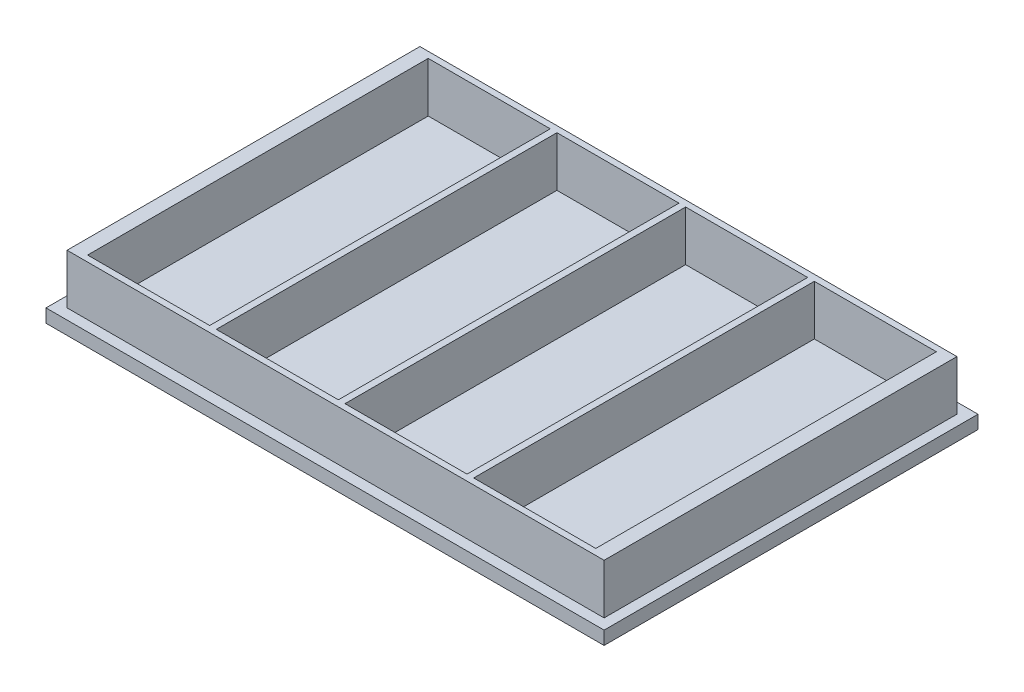
ISO-10303-21;
HEADER;
FILE_DESCRIPTION(('STEP AP214'),'2;1');
FILE_NAME('part.step','',(''),(''),'','','');
FILE_SCHEMA(('AUTOMOTIVE_DESIGN { 1 0 10303 214 1 1 1 1 }'));
ENDSEC;
DATA;
#1=APPLICATION_CONTEXT('core data for automotive mechanical design processes');
#2=APPLICATION_PROTOCOL_DEFINITION('international standard','automotive_design',2000,#1);
#3=PRODUCT_CONTEXT('',#1,'mechanical');
#4=PRODUCT('Part','Part','',(#3));
#5=PRODUCT_RELATED_PRODUCT_CATEGORY('part','',(#4));
#6=PRODUCT_DEFINITION_FORMATION('','',#4);
#7=PRODUCT_DEFINITION_CONTEXT('part definition',#1,'design');
#8=PRODUCT_DEFINITION('design','',#6,#7);
#9=PRODUCT_DEFINITION_SHAPE('','',#8);
#10=(LENGTH_UNIT() NAMED_UNIT(*) SI_UNIT(.MILLI.,.METRE.));
#11=(NAMED_UNIT(*) PLANE_ANGLE_UNIT() SI_UNIT($,.RADIAN.));
#12=(NAMED_UNIT(*) SI_UNIT($,.STERADIAN.) SOLID_ANGLE_UNIT());
#13=UNCERTAINTY_MEASURE_WITH_UNIT(LENGTH_MEASURE(1.E-05),#10,'distance_accuracy_value','');
#14=(GEOMETRIC_REPRESENTATION_CONTEXT(3) GLOBAL_UNCERTAINTY_ASSIGNED_CONTEXT((#13)) GLOBAL_UNIT_ASSIGNED_CONTEXT((#10,
#11,#12)) REPRESENTATION_CONTEXT('',''));
#15=CARTESIAN_POINT('',(0.,0.,0.));
#16=DIRECTION('',(0.,0.,1.));
#17=DIRECTION('',(1.,0.,0.));
#18=AXIS2_PLACEMENT_3D('',#15,#16,#17);
#19=CARTESIAN_POINT('',(0.,3.048,0.));
#20=DIRECTION('',(0.,1.,0.));
#21=DIRECTION('',(0.,0.,1.));
#22=AXIS2_PLACEMENT_3D('',#19,#20,#21);
#23=PLANE('',#22);
#24=DIRECTION('',(1.,0.,0.));
#25=VECTOR('',#24,1.);
#26=CARTESIAN_POINT('',(0.,3.048,2.413));
#27=LINE('',#26,#25);
#28=CARTESIAN_POINT('',(2.413,3.048,2.413));
#29=VERTEX_POINT('',#28);
#30=CARTESIAN_POINT('',(125.349,3.048,2.413));
#31=VERTEX_POINT('',#30);
#32=EDGE_CURVE('E337',#29,#31,#27,.T.);
#33=ORIENTED_EDGE('',*,*,#32,.T.);
#34=DIRECTION('',(0.,0.,1.));
#35=VECTOR('',#34,1.);
#36=CARTESIAN_POINT('',(125.349,3.048,0.));
#37=LINE('',#36,#35);
#38=CARTESIAN_POINT('',(125.349,3.048,83.185));
#39=VERTEX_POINT('',#38);
#40=EDGE_CURVE('E295',#31,#39,#37,.T.);
#41=ORIENTED_EDGE('',*,*,#40,.T.);
#42=DIRECTION('',(1.,0.,0.));
#43=VECTOR('',#42,1.);
#44=CARTESIAN_POINT('',(0.,3.048,83.185));
#45=LINE('',#44,#43);
#46=CARTESIAN_POINT('',(2.413,3.048,83.185));
#47=VERTEX_POINT('',#46);
#48=EDGE_CURVE('E126',#47,#39,#45,.T.);
#49=ORIENTED_EDGE('',*,*,#48,.F.);
#50=DIRECTION('',(0.,0.,1.));
#51=VECTOR('',#50,1.);
#52=CARTESIAN_POINT('',(2.413,3.048,0.));
#53=LINE('',#52,#51);
#54=EDGE_CURVE('E121',#29,#47,#53,.T.);
#55=ORIENTED_EDGE('',*,*,#54,.F.);
#56=EDGE_LOOP('',(#33,#41,#49,#55));
#57=FACE_BOUND('',#56,.T.);
#58=DIRECTION('',(0.,0.,1.));
#59=VECTOR('',#58,1.);
#60=CARTESIAN_POINT('',(0.,3.048,0.));
#61=LINE('',#60,#59);
#62=CARTESIAN_POINT('',(0.,3.048,0.));
#63=VERTEX_POINT('',#62);
#64=CARTESIAN_POINT('',(0.,3.048,85.598));
#65=VERTEX_POINT('',#64);
#66=EDGE_CURVE('E462',#63,#65,#61,.T.);
#67=ORIENTED_EDGE('',*,*,#66,.T.);
#68=DIRECTION('',(1.,0.,0.));
#69=VECTOR('',#68,1.);
#70=CARTESIAN_POINT('',(0.,3.048,85.598));
#71=LINE('',#70,#69);
#72=CARTESIAN_POINT('',(127.762,3.048,85.598));
#73=VERTEX_POINT('',#72);
#74=EDGE_CURVE('E465',#65,#73,#71,.T.);
#75=ORIENTED_EDGE('',*,*,#74,.T.);
#76=DIRECTION('',(0.,0.,-1.));
#77=VECTOR('',#76,1.);
#78=CARTESIAN_POINT('',(127.762,3.048,0.));
#79=LINE('',#78,#77);
#80=CARTESIAN_POINT('',(127.762,3.048,0.));
#81=VERTEX_POINT('',#80);
#82=EDGE_CURVE('E468',#73,#81,#79,.T.);
#83=ORIENTED_EDGE('',*,*,#82,.T.);
#84=DIRECTION('',(-1.,0.,0.));
#85=VECTOR('',#84,1.);
#86=CARTESIAN_POINT('',(0.,3.048,0.));
#87=LINE('',#86,#85);
#88=EDGE_CURVE('E470',#81,#63,#87,.T.);
#89=ORIENTED_EDGE('',*,*,#88,.T.);
#90=EDGE_LOOP('',(#67,#75,#83,#89));
#91=FACE_BOUND('',#90,.T.);
#92=ADVANCED_FACE('F106',(#57,#91),#23,.T.);
#93=CARTESIAN_POINT('',(2.413,3.048,2.413));
#94=DIRECTION('',(1.,0.,0.));
#95=DIRECTION('',(0.,0.,-1.));
#96=AXIS2_PLACEMENT_3D('',#93,#94,#95);
#97=PLANE('',#96);
#98=DIRECTION('',(0.,-1.,0.));
#99=VECTOR('',#98,1.);
#100=CARTESIAN_POINT('',(2.413,3.048,2.413));
#101=LINE('',#100,#99);
#102=CARTESIAN_POINT('',(2.413,0.635000000000001,2.413));
#103=VERTEX_POINT('',#102);
#104=CARTESIAN_POINT('',(2.413,0.,2.413));
#105=VERTEX_POINT('',#104);
#106=EDGE_CURVE('E453',#103,#105,#101,.T.);
#107=ORIENTED_EDGE('',*,*,#106,.F.);
#108=DIRECTION('',(0.,0.,1.));
#109=VECTOR('',#108,1.);
#110=CARTESIAN_POINT('',(2.413,0.635,2.413));
#111=LINE('',#110,#109);
#112=CARTESIAN_POINT('',(2.413,0.635,83.185));
#113=VERTEX_POINT('',#112);
#114=EDGE_CURVE('E393',#103,#113,#111,.T.);
#115=ORIENTED_EDGE('',*,*,#114,.T.);
#116=DIRECTION('',(0.,-1.,0.));
#117=VECTOR('',#116,1.);
#118=CARTESIAN_POINT('',(2.41300000000001,3.048,83.185));
#119=LINE('',#118,#117);
#120=CARTESIAN_POINT('',(2.41300000000001,0.,83.185));
#121=VERTEX_POINT('',#120);
#122=EDGE_CURVE('E459',#113,#121,#119,.T.);
#123=ORIENTED_EDGE('',*,*,#122,.T.);
#124=DIRECTION('',(0.,0.,1.));
#125=VECTOR('',#124,1.);
#126=CARTESIAN_POINT('',(2.413,0.,2.413));
#127=LINE('',#126,#125);
#128=EDGE_CURVE('E441',#105,#121,#127,.T.);
#129=ORIENTED_EDGE('',*,*,#128,.F.);
#130=EDGE_LOOP('',(#107,#115,#123,#129));
#131=FACE_BOUND('',#130,.T.);
#132=ADVANCED_FACE('F513',(#131),#97,.T.);
#133=CARTESIAN_POINT('',(2.41300000000001,3.048,83.185));
#134=DIRECTION('',(0.,0.,-1.));
#135=DIRECTION('',(-1.,0.,0.));
#136=AXIS2_PLACEMENT_3D('',#133,#134,#135);
#137=PLANE('',#136);
#138=ORIENTED_EDGE('',*,*,#122,.F.);
#139=DIRECTION('',(1.,0.,0.));
#140=VECTOR('',#139,1.);
#141=CARTESIAN_POINT('',(2.413,0.635,83.185));
#142=LINE('',#141,#140);
#143=CARTESIAN_POINT('',(125.349,0.635,83.185));
#144=VERTEX_POINT('',#143);
#145=EDGE_CURVE('E432',#113,#144,#142,.T.);
#146=ORIENTED_EDGE('',*,*,#145,.T.);
#147=DIRECTION('',(0.,-1.,0.));
#148=VECTOR('',#147,1.);
#149=CARTESIAN_POINT('',(125.349,3.048,83.185));
#150=LINE('',#149,#148);
#151=CARTESIAN_POINT('',(125.349,0.,83.185));
#152=VERTEX_POINT('',#151);
#153=EDGE_CURVE('E457',#144,#152,#150,.T.);
#154=ORIENTED_EDGE('',*,*,#153,.T.);
#155=DIRECTION('',(1.,0.,0.));
#156=VECTOR('',#155,1.);
#157=CARTESIAN_POINT('',(2.41300000000001,0.,83.185));
#158=LINE('',#157,#156);
#159=EDGE_CURVE('E444',#121,#152,#158,.T.);
#160=ORIENTED_EDGE('',*,*,#159,.F.);
#161=EDGE_LOOP('',(#138,#146,#154,#160));
#162=FACE_BOUND('',#161,.T.);
#163=ADVANCED_FACE('F520',(#162),#137,.T.);
#164=CARTESIAN_POINT('',(125.349,3.048,2.413));
#165=DIRECTION('',(-1.,0.,0.));
#166=DIRECTION('',(0.,0.,1.));
#167=AXIS2_PLACEMENT_3D('',#164,#165,#166);
#168=PLANE('',#167);
#169=ORIENTED_EDGE('',*,*,#153,.F.);
#170=DIRECTION('',(0.,0.,-1.));
#171=VECTOR('',#170,1.);
#172=CARTESIAN_POINT('',(125.349,0.635,2.413));
#173=LINE('',#172,#171);
#174=CARTESIAN_POINT('',(125.349,0.635,2.413));
#175=VERTEX_POINT('',#174);
#176=EDGE_CURVE('E435',#144,#175,#173,.T.);
#177=ORIENTED_EDGE('',*,*,#176,.T.);
#178=DIRECTION('',(0.,-1.,0.));
#179=VECTOR('',#178,1.);
#180=CARTESIAN_POINT('',(125.349,3.048,2.413));
#181=LINE('',#180,#179);
#182=CARTESIAN_POINT('',(125.349,0.,2.413));
#183=VERTEX_POINT('',#182);
#184=EDGE_CURVE('E455',#175,#183,#181,.T.);
#185=ORIENTED_EDGE('',*,*,#184,.T.);
#186=DIRECTION('',(0.,0.,-1.));
#187=VECTOR('',#186,1.);
#188=CARTESIAN_POINT('',(125.349,0.,2.413));
#189=LINE('',#188,#187);
#190=EDGE_CURVE('E447',#152,#183,#189,.T.);
#191=ORIENTED_EDGE('',*,*,#190,.F.);
#192=EDGE_LOOP('',(#169,#177,#185,#191));
#193=FACE_BOUND('',#192,.T.);
#194=ADVANCED_FACE('F659',(#193),#168,.T.);
#195=CARTESIAN_POINT('',(2.413,3.048,2.413));
#196=DIRECTION('',(0.,0.,1.));
#197=DIRECTION('',(1.,0.,0.));
#198=AXIS2_PLACEMENT_3D('',#195,#196,#197);
#199=PLANE('',#198);
#200=ORIENTED_EDGE('',*,*,#184,.F.);
#201=DIRECTION('',(-1.,0.,0.));
#202=VECTOR('',#201,1.);
#203=CARTESIAN_POINT('',(2.413,0.635,2.413));
#204=LINE('',#203,#202);
#205=EDGE_CURVE('E438',#175,#103,#204,.T.);
#206=ORIENTED_EDGE('',*,*,#205,.T.);
#207=ORIENTED_EDGE('',*,*,#106,.T.);
#208=DIRECTION('',(-1.,0.,0.));
#209=VECTOR('',#208,1.);
#210=CARTESIAN_POINT('',(2.413,0.,2.413));
#211=LINE('',#210,#209);
#212=EDGE_CURVE('E450',#183,#105,#211,.T.);
#213=ORIENTED_EDGE('',*,*,#212,.F.);
#214=EDGE_LOOP('',(#200,#206,#207,#213));
#215=FACE_BOUND('',#214,.T.);
#216=ADVANCED_FACE('F656',(#215),#199,.T.);
#217=CARTESIAN_POINT('',(0.,0.,0.));
#218=DIRECTION('',(0.,1.,0.));
#219=DIRECTION('',(0.,0.,1.));
#220=AXIS2_PLACEMENT_3D('',#217,#218,#219);
#221=PLANE('',#220);
#222=DIRECTION('',(0.,0.,1.));
#223=VECTOR('',#222,1.);
#224=CARTESIAN_POINT('',(0.,0.,0.));
#225=LINE('',#224,#223);
#226=CARTESIAN_POINT('',(0.,0.,0.));
#227=VERTEX_POINT('',#226);
#228=CARTESIAN_POINT('',(0.,0.,85.598));
#229=VERTEX_POINT('',#228);
#230=EDGE_CURVE('E461',#227,#229,#225,.T.);
#231=ORIENTED_EDGE('',*,*,#230,.F.);
#232=DIRECTION('',(-1.,0.,0.));
#233=VECTOR('',#232,1.);
#234=CARTESIAN_POINT('',(0.,0.,0.));
#235=LINE('',#234,#233);
#236=CARTESIAN_POINT('',(127.762,0.,0.));
#237=VERTEX_POINT('',#236);
#238=EDGE_CURVE('E466',#237,#227,#235,.T.);
#239=ORIENTED_EDGE('',*,*,#238,.F.);
#240=DIRECTION('',(0.,0.,-1.));
#241=VECTOR('',#240,1.);
#242=CARTESIAN_POINT('',(127.762,0.,0.));
#243=LINE('',#242,#241);
#244=CARTESIAN_POINT('',(127.762,0.,85.598));
#245=VERTEX_POINT('',#244);
#246=EDGE_CURVE('E477',#245,#237,#243,.T.);
#247=ORIENTED_EDGE('',*,*,#246,.F.);
#248=DIRECTION('',(1.,0.,0.));
#249=VECTOR('',#248,1.);
#250=CARTESIAN_POINT('',(0.,0.,85.598));
#251=LINE('',#250,#249);
#252=EDGE_CURVE('E475',#229,#245,#251,.T.);
#253=ORIENTED_EDGE('',*,*,#252,.F.);
#254=EDGE_LOOP('',(#231,#239,#247,#253));
#255=FACE_BOUND('',#254,.T.);
#256=ORIENTED_EDGE('',*,*,#128,.T.);
#257=ORIENTED_EDGE('',*,*,#159,.T.);
#258=ORIENTED_EDGE('',*,*,#190,.T.);
#259=ORIENTED_EDGE('',*,*,#212,.T.);
#260=EDGE_LOOP('',(#256,#257,#258,#259));
#261=FACE_BOUND('',#260,.T.);
#262=ADVANCED_FACE('F495',(#255,#261),#221,.F.);
#263=CARTESIAN_POINT('',(0.,3.048,0.));
#264=DIRECTION('',(1.,0.,0.));
#265=DIRECTION('',(0.,0.,-1.));
#266=AXIS2_PLACEMENT_3D('',#263,#264,#265);
#267=PLANE('',#266);
#268=ORIENTED_EDGE('',*,*,#230,.T.);
#269=DIRECTION('',(0.,-1.,0.));
#270=VECTOR('',#269,1.);
#271=CARTESIAN_POINT('',(0.,3.048,85.598));
#272=LINE('',#271,#270);
#273=EDGE_CURVE('E12',#65,#229,#272,.T.);
#274=ORIENTED_EDGE('',*,*,#273,.F.);
#275=ORIENTED_EDGE('',*,*,#66,.F.);
#276=DIRECTION('',(0.,-1.,0.));
#277=VECTOR('',#276,1.);
#278=CARTESIAN_POINT('',(0.,3.048,0.));
#279=LINE('',#278,#277);
#280=EDGE_CURVE('E472',#63,#227,#279,.T.);
#281=ORIENTED_EDGE('',*,*,#280,.T.);
#282=EDGE_LOOP('',(#268,#274,#275,#281));
#283=FACE_BOUND('',#282,.T.);
#284=ADVANCED_FACE('F108',(#283),#267,.F.);
#285=CARTESIAN_POINT('',(0.,3.048,85.598));
#286=DIRECTION('',(0.,0.,-1.));
#287=DIRECTION('',(-1.,0.,0.));
#288=AXIS2_PLACEMENT_3D('',#285,#286,#287);
#289=PLANE('',#288);
#290=ORIENTED_EDGE('',*,*,#252,.T.);
#291=DIRECTION('',(0.,-1.,0.));
#292=VECTOR('',#291,1.);
#293=CARTESIAN_POINT('',(127.762,3.048,85.598));
#294=LINE('',#293,#292);
#295=EDGE_CURVE('E114',#73,#245,#294,.T.);
#296=ORIENTED_EDGE('',*,*,#295,.F.);
#297=ORIENTED_EDGE('',*,*,#74,.F.);
#298=ORIENTED_EDGE('',*,*,#273,.T.);
#299=EDGE_LOOP('',(#290,#296,#297,#298));
#300=FACE_BOUND('',#299,.T.);
#301=ADVANCED_FACE('F505',(#300),#289,.F.);
#302=CARTESIAN_POINT('',(127.762,3.048,0.));
#303=DIRECTION('',(-1.,0.,0.));
#304=DIRECTION('',(0.,0.,1.));
#305=AXIS2_PLACEMENT_3D('',#302,#303,#304);
#306=PLANE('',#305);
#307=ORIENTED_EDGE('',*,*,#246,.T.);
#308=DIRECTION('',(0.,-1.,0.));
#309=VECTOR('',#308,1.);
#310=CARTESIAN_POINT('',(127.762,3.048,0.));
#311=LINE('',#310,#309);
#312=EDGE_CURVE('E482',#81,#237,#311,.T.);
#313=ORIENTED_EDGE('',*,*,#312,.F.);
#314=ORIENTED_EDGE('',*,*,#82,.F.);
#315=ORIENTED_EDGE('',*,*,#295,.T.);
#316=EDGE_LOOP('',(#307,#313,#314,#315));
#317=FACE_BOUND('',#316,.T.);
#318=ADVANCED_FACE('F489',(#317),#306,.F.);
#319=CARTESIAN_POINT('',(0.,3.048,0.));
#320=DIRECTION('',(0.,0.,1.));
#321=DIRECTION('',(1.,0.,0.));
#322=AXIS2_PLACEMENT_3D('',#319,#320,#321);
#323=PLANE('',#322);
#324=ORIENTED_EDGE('',*,*,#238,.T.);
#325=ORIENTED_EDGE('',*,*,#280,.F.);
#326=ORIENTED_EDGE('',*,*,#88,.F.);
#327=ORIENTED_EDGE('',*,*,#312,.T.);
#328=EDGE_LOOP('',(#324,#325,#326,#327));
#329=FACE_BOUND('',#328,.T.);
#330=ADVANCED_FACE('F499',(#329),#323,.F.);
#331=CARTESIAN_POINT('',(0.,0.635,0.));
#332=DIRECTION('',(0.,1.,0.));
#333=DIRECTION('',(0.,0.,1.));
#334=AXIS2_PLACEMENT_3D('',#331,#332,#333);
#335=PLANE('',#334);
#336=ORIENTED_EDGE('',*,*,#114,.F.);
#337=ORIENTED_EDGE('',*,*,#205,.F.);
#338=ORIENTED_EDGE('',*,*,#176,.F.);
#339=ORIENTED_EDGE('',*,*,#145,.F.);
#340=EDGE_LOOP('',(#336,#337,#338,#339));
#341=FACE_BOUND('',#340,.T.);
#342=ADVANCED_FACE('F624',(#341),#335,.F.);
#343=CARTESIAN_POINT('',(0.,14.478,3.81));
#344=DIRECTION('',(0.,0.,-1.));
#345=DIRECTION('',(-1.,0.,0.));
#346=AXIS2_PLACEMENT_3D('',#343,#344,#345);
#347=PLANE('',#346);
#348=DIRECTION('',(1.,0.,0.));
#349=VECTOR('',#348,1.);
#350=CARTESIAN_POINT('',(0.,14.478,3.81));
#351=LINE('',#350,#349);
#352=CARTESIAN_POINT('',(35.179,14.478,3.81));
#353=VERTEX_POINT('',#352);
#354=CARTESIAN_POINT('',(63.119,14.478,3.81));
#355=VERTEX_POINT('',#354);
#356=EDGE_CURVE('E324',#353,#355,#351,.T.);
#357=ORIENTED_EDGE('',*,*,#356,.F.);
#358=DIRECTION('',(0.,-1.,0.));
#359=VECTOR('',#358,1.);
#360=CARTESIAN_POINT('',(35.179,14.478,3.81));
#361=LINE('',#360,#359);
#362=CARTESIAN_POINT('',(35.179,3.048,3.81));
#363=VERTEX_POINT('',#362);
#364=EDGE_CURVE('E387',#353,#363,#361,.T.);
#365=ORIENTED_EDGE('',*,*,#364,.T.);
#366=DIRECTION('',(1.,0.,0.));
#367=VECTOR('',#366,1.);
#368=CARTESIAN_POINT('',(0.,3.048,3.81));
#369=LINE('',#368,#367);
#370=CARTESIAN_POINT('',(63.119,3.048,3.81));
#371=VERTEX_POINT('',#370);
#372=EDGE_CURVE('E346',#363,#371,#369,.T.);
#373=ORIENTED_EDGE('',*,*,#372,.T.);
#374=DIRECTION('',(0.,1.,0.));
#375=VECTOR('',#374,1.);
#376=CARTESIAN_POINT('',(63.119,14.478,3.81));
#377=LINE('',#376,#375);
#378=EDGE_CURVE('E384',#371,#355,#377,.T.);
#379=ORIENTED_EDGE('',*,*,#378,.T.);
#380=EDGE_LOOP('',(#357,#365,#373,#379));
#381=FACE_BOUND('',#380,.T.);
#382=ADVANCED_FACE('F555',(#381),#347,.F.);
#383=CARTESIAN_POINT('',(64.643,14.478,3.81));
#384=VERTEX_POINT('',#383);
#385=CARTESIAN_POINT('',(92.583,14.478,3.81));
#386=VERTEX_POINT('',#385);
#387=EDGE_CURVE('E597',#384,#386,#351,.T.);
#388=ORIENTED_EDGE('',*,*,#387,.F.);
#389=DIRECTION('',(0.,-1.,0.));
#390=VECTOR('',#389,1.);
#391=CARTESIAN_POINT('',(64.643,14.478,3.81));
#392=LINE('',#391,#390);
#393=CARTESIAN_POINT('',(64.643,3.048,3.81));
#394=VERTEX_POINT('',#393);
#395=EDGE_CURVE('E386',#384,#394,#392,.T.);
#396=ORIENTED_EDGE('',*,*,#395,.T.);
#397=CARTESIAN_POINT('',(92.583,3.048,3.81));
#398=VERTEX_POINT('',#397);
#399=EDGE_CURVE('E557',#394,#398,#369,.T.);
#400=ORIENTED_EDGE('',*,*,#399,.T.);
#401=DIRECTION('',(0.,1.,0.));
#402=VECTOR('',#401,1.);
#403=CARTESIAN_POINT('',(92.583,14.478,3.81));
#404=LINE('',#403,#402);
#405=EDGE_CURVE('E381',#398,#386,#404,.T.);
#406=ORIENTED_EDGE('',*,*,#405,.T.);
#407=EDGE_LOOP('',(#388,#396,#400,#406));
#408=FACE_BOUND('',#407,.T.);
#409=ADVANCED_FACE('F620',(#408),#347,.F.);
#410=CARTESIAN_POINT('',(94.107,14.478,3.81));
#411=VERTEX_POINT('',#410);
#412=CARTESIAN_POINT('',(122.047,14.478,3.81));
#413=VERTEX_POINT('',#412);
#414=EDGE_CURVE('E319',#411,#413,#351,.T.);
#415=ORIENTED_EDGE('',*,*,#414,.F.);
#416=DIRECTION('',(0.,-1.,0.));
#417=VECTOR('',#416,1.);
#418=CARTESIAN_POINT('',(94.107,14.478,3.81));
#419=LINE('',#418,#417);
#420=CARTESIAN_POINT('',(94.107,3.048,3.81));
#421=VERTEX_POINT('',#420);
#422=EDGE_CURVE('E383',#411,#421,#419,.T.);
#423=ORIENTED_EDGE('',*,*,#422,.T.);
#424=CARTESIAN_POINT('',(122.047,3.048,3.81));
#425=VERTEX_POINT('',#424);
#426=EDGE_CURVE('E342',#421,#425,#369,.T.);
#427=ORIENTED_EDGE('',*,*,#426,.T.);
#428=DIRECTION('',(0.,-1.,0.));
#429=VECTOR('',#428,1.);
#430=CARTESIAN_POINT('',(122.047,14.478,3.81));
#431=LINE('',#430,#429);
#432=EDGE_CURVE('E361',#413,#425,#431,.T.);
#433=ORIENTED_EDGE('',*,*,#432,.F.);
#434=EDGE_LOOP('',(#415,#423,#427,#433));
#435=FACE_BOUND('',#434,.T.);
#436=ADVANCED_FACE('F565',(#435),#347,.F.);
#437=CARTESIAN_POINT('',(122.047,14.478,0.));
#438=DIRECTION('',(1.,0.,0.));
#439=DIRECTION('',(0.,0.,-1.));
#440=AXIS2_PLACEMENT_3D('',#437,#438,#439);
#441=PLANE('',#440);
#442=DIRECTION('',(0.,0.,1.));
#443=VECTOR('',#442,1.);
#444=CARTESIAN_POINT('',(122.047,3.048,0.));
#445=LINE('',#444,#443);
#446=CARTESIAN_POINT('',(122.047,3.048,81.788));
#447=VERTEX_POINT('',#446);
#448=EDGE_CURVE('E345',#425,#447,#445,.T.);
#449=ORIENTED_EDGE('',*,*,#448,.T.);
#450=DIRECTION('',(0.,-1.,0.));
#451=VECTOR('',#450,1.);
#452=CARTESIAN_POINT('',(122.047,14.478,81.788));
#453=LINE('',#452,#451);
#454=CARTESIAN_POINT('',(122.047,14.478,81.788));
#455=VERTEX_POINT('',#454);
#456=EDGE_CURVE('E359',#455,#447,#453,.T.);
#457=ORIENTED_EDGE('',*,*,#456,.F.);
#458=DIRECTION('',(0.,0.,1.));
#459=VECTOR('',#458,1.);
#460=CARTESIAN_POINT('',(122.047,14.478,0.));
#461=LINE('',#460,#459);
#462=EDGE_CURVE('E323',#413,#455,#461,.T.);
#463=ORIENTED_EDGE('',*,*,#462,.F.);
#464=ORIENTED_EDGE('',*,*,#432,.T.);
#465=EDGE_LOOP('',(#449,#457,#463,#464));
#466=FACE_BOUND('',#465,.T.);
#467=ADVANCED_FACE('F569',(#466),#441,.F.);
#468=CARTESIAN_POINT('',(0.,14.478,81.788));
#469=DIRECTION('',(0.,0.,-1.));
#470=DIRECTION('',(-1.,0.,0.));
#471=AXIS2_PLACEMENT_3D('',#468,#469,#470);
#472=PLANE('',#471);
#473=DIRECTION('',(1.,0.,0.));
#474=VECTOR('',#473,1.);
#475=CARTESIAN_POINT('',(0.,3.048,81.788));
#476=LINE('',#475,#474);
#477=CARTESIAN_POINT('',(94.107,3.048,81.788));
#478=VERTEX_POINT('',#477);
#479=EDGE_CURVE('E349',#478,#447,#476,.T.);
#480=ORIENTED_EDGE('',*,*,#479,.F.);
#481=DIRECTION('',(0.,1.,0.));
#482=VECTOR('',#481,1.);
#483=CARTESIAN_POINT('',(94.107,14.478,81.788));
#484=LINE('',#483,#482);
#485=CARTESIAN_POINT('',(94.107,14.478,81.788));
#486=VERTEX_POINT('',#485);
#487=EDGE_CURVE('E371',#478,#486,#484,.T.);
#488=ORIENTED_EDGE('',*,*,#487,.T.);
#489=DIRECTION('',(1.,0.,0.));
#490=VECTOR('',#489,1.);
#491=CARTESIAN_POINT('',(0.,14.478,81.788));
#492=LINE('',#491,#490);
#493=EDGE_CURVE('E327',#486,#455,#492,.T.);
#494=ORIENTED_EDGE('',*,*,#493,.T.);
#495=ORIENTED_EDGE('',*,*,#456,.T.);
#496=EDGE_LOOP('',(#480,#488,#494,#495));
#497=FACE_BOUND('',#496,.T.);
#498=ADVANCED_FACE('F594',(#497),#472,.T.);
#499=CARTESIAN_POINT('',(64.643,3.048,81.788));
#500=VERTEX_POINT('',#499);
#501=CARTESIAN_POINT('',(92.583,3.048,81.788));
#502=VERTEX_POINT('',#501);
#503=EDGE_CURVE('E574',#500,#502,#476,.T.);
#504=ORIENTED_EDGE('',*,*,#503,.F.);
#505=DIRECTION('',(0.,1.,0.));
#506=VECTOR('',#505,1.);
#507=CARTESIAN_POINT('',(64.643,14.478,81.788));
#508=LINE('',#507,#506);
#509=CARTESIAN_POINT('',(64.643,14.478,81.788));
#510=VERTEX_POINT('',#509);
#511=EDGE_CURVE('E375',#500,#510,#508,.T.);
#512=ORIENTED_EDGE('',*,*,#511,.T.);
#513=CARTESIAN_POINT('',(92.583,14.478,81.788));
#514=VERTEX_POINT('',#513);
#515=EDGE_CURVE('E590',#510,#514,#492,.T.);
#516=ORIENTED_EDGE('',*,*,#515,.T.);
#517=DIRECTION('',(0.,1.,0.));
#518=VECTOR('',#517,1.);
#519=CARTESIAN_POINT('',(92.583,14.478,81.788));
#520=LINE('',#519,#518);
#521=EDGE_CURVE('E364',#502,#514,#520,.T.);
#522=ORIENTED_EDGE('',*,*,#521,.F.);
#523=EDGE_LOOP('',(#504,#512,#516,#522));
#524=FACE_BOUND('',#523,.T.);
#525=ADVANCED_FACE('F580',(#524),#472,.T.);
#526=DIRECTION('',(0.,-1.,0.));
#527=VECTOR('',#526,1.);
#528=CARTESIAN_POINT('',(35.179,14.478,81.788));
#529=LINE('',#528,#527);
#530=CARTESIAN_POINT('',(35.179,14.478,81.788));
#531=VERTEX_POINT('',#530);
#532=CARTESIAN_POINT('',(35.179,3.048,81.788));
#533=VERTEX_POINT('',#532);
#534=EDGE_CURVE('E377',#531,#533,#529,.T.);
#535=ORIENTED_EDGE('',*,*,#534,.F.);
#536=CARTESIAN_POINT('',(63.119,14.478,81.788));
#537=VERTEX_POINT('',#536);
#538=EDGE_CURVE('E332',#531,#537,#492,.T.);
#539=ORIENTED_EDGE('',*,*,#538,.T.);
#540=DIRECTION('',(0.,1.,0.));
#541=VECTOR('',#540,1.);
#542=CARTESIAN_POINT('',(63.119,14.478,81.788));
#543=LINE('',#542,#541);
#544=CARTESIAN_POINT('',(63.119,3.048,81.788));
#545=VERTEX_POINT('',#544);
#546=EDGE_CURVE('E373',#545,#537,#543,.T.);
#547=ORIENTED_EDGE('',*,*,#546,.F.);
#548=EDGE_CURVE('E353',#533,#545,#476,.T.);
#549=ORIENTED_EDGE('',*,*,#548,.F.);
#550=EDGE_LOOP('',(#535,#539,#547,#549));
#551=FACE_BOUND('',#550,.T.);
#552=ADVANCED_FACE('F601',(#551),#472,.T.);
#553=CARTESIAN_POINT('',(5.71500000000001,14.478,81.788));
#554=VERTEX_POINT('',#553);
#555=CARTESIAN_POINT('',(33.655,14.478,81.788));
#556=VERTEX_POINT('',#555);
#557=EDGE_CURVE('E328',#554,#556,#492,.T.);
#558=ORIENTED_EDGE('',*,*,#557,.T.);
#559=DIRECTION('',(0.,-1.,0.));
#560=VECTOR('',#559,1.);
#561=CARTESIAN_POINT('',(33.655,14.478,81.788));
#562=LINE('',#561,#560);
#563=CARTESIAN_POINT('',(33.655,3.048,81.788));
#564=VERTEX_POINT('',#563);
#565=EDGE_CURVE('E380',#556,#564,#562,.T.);
#566=ORIENTED_EDGE('',*,*,#565,.T.);
#567=CARTESIAN_POINT('',(5.71500000000001,3.048,81.788));
#568=VERTEX_POINT('',#567);
#569=EDGE_CURVE('E350',#568,#564,#476,.T.);
#570=ORIENTED_EDGE('',*,*,#569,.F.);
#571=DIRECTION('',(0.,-1.,0.));
#572=VECTOR('',#571,1.);
#573=CARTESIAN_POINT('',(5.71500000000001,14.478,81.788));
#574=LINE('',#573,#572);
#575=EDGE_CURVE('E357',#554,#568,#574,.T.);
#576=ORIENTED_EDGE('',*,*,#575,.F.);
#577=EDGE_LOOP('',(#558,#566,#570,#576));
#578=FACE_BOUND('',#577,.T.);
#579=ADVANCED_FACE('F603',(#578),#472,.T.);
#580=CARTESIAN_POINT('',(5.715,14.478,0.));
#581=DIRECTION('',(1.,0.,0.));
#582=DIRECTION('',(0.,0.,-1.));
#583=AXIS2_PLACEMENT_3D('',#580,#581,#582);
#584=PLANE('',#583);
#585=DIRECTION('',(0.,0.,1.));
#586=VECTOR('',#585,1.);
#587=CARTESIAN_POINT('',(5.715,3.048,0.));
#588=LINE('',#587,#586);
#589=CARTESIAN_POINT('',(5.715,3.048,3.81));
#590=VERTEX_POINT('',#589);
#591=EDGE_CURVE('E310',#590,#568,#588,.T.);
#592=ORIENTED_EDGE('',*,*,#591,.F.);
#593=DIRECTION('',(0.,-1.,0.));
#594=VECTOR('',#593,1.);
#595=CARTESIAN_POINT('',(5.715,14.478,3.81));
#596=LINE('',#595,#594);
#597=CARTESIAN_POINT('',(5.715,14.478,3.81));
#598=VERTEX_POINT('',#597);
#599=EDGE_CURVE('E299',#598,#590,#596,.T.);
#600=ORIENTED_EDGE('',*,*,#599,.F.);
#601=DIRECTION('',(0.,0.,1.));
#602=VECTOR('',#601,1.);
#603=CARTESIAN_POINT('',(5.715,14.478,0.));
#604=LINE('',#603,#602);
#605=EDGE_CURVE('E331',#598,#554,#604,.T.);
#606=ORIENTED_EDGE('',*,*,#605,.T.);
#607=ORIENTED_EDGE('',*,*,#575,.T.);
#608=EDGE_LOOP('',(#592,#600,#606,#607));
#609=FACE_BOUND('',#608,.T.);
#610=ADVANCED_FACE('F609',(#609),#584,.T.);
#611=DIRECTION('',(0.,-1.,0.));
#612=VECTOR('',#611,1.);
#613=CARTESIAN_POINT('',(33.655,14.478,3.81));
#614=LINE('',#613,#612);
#615=CARTESIAN_POINT('',(33.655,14.478,3.81));
#616=VERTEX_POINT('',#615);
#617=CARTESIAN_POINT('',(33.655,3.048,3.81));
#618=VERTEX_POINT('',#617);
#619=EDGE_CURVE('E390',#616,#618,#614,.T.);
#620=ORIENTED_EDGE('',*,*,#619,.F.);
#621=EDGE_CURVE('E320',#598,#616,#351,.T.);
#622=ORIENTED_EDGE('',*,*,#621,.F.);
#623=ORIENTED_EDGE('',*,*,#599,.T.);
#624=EDGE_CURVE('E343',#590,#618,#369,.T.);
#625=ORIENTED_EDGE('',*,*,#624,.T.);
#626=EDGE_LOOP('',(#620,#622,#623,#625));
#627=FACE_BOUND('',#626,.T.);
#628=ADVANCED_FACE('F625',(#627),#347,.F.);
#629=CARTESIAN_POINT('',(0.,14.478,2.413));
#630=DIRECTION('',(0.,0.,-1.));
#631=DIRECTION('',(-1.,0.,0.));
#632=AXIS2_PLACEMENT_3D('',#629,#630,#631);
#633=PLANE('',#632);
#634=ORIENTED_EDGE('',*,*,#32,.F.);
#635=DIRECTION('',(0.,-1.,0.));
#636=VECTOR('',#635,1.);
#637=CARTESIAN_POINT('',(2.413,14.478,2.413));
#638=LINE('',#637,#636);
#639=CARTESIAN_POINT('',(2.413,14.478,2.413));
#640=VERTEX_POINT('',#639);
#641=EDGE_CURVE('E300',#640,#29,#638,.T.);
#642=ORIENTED_EDGE('',*,*,#641,.F.);
#643=DIRECTION('',(1.,0.,0.));
#644=VECTOR('',#643,1.);
#645=CARTESIAN_POINT('',(0.,14.478,2.413));
#646=LINE('',#645,#644);
#647=CARTESIAN_POINT('',(125.349,14.478,2.413));
#648=VERTEX_POINT('',#647);
#649=EDGE_CURVE('E306',#640,#648,#646,.T.);
#650=ORIENTED_EDGE('',*,*,#649,.T.);
#651=DIRECTION('',(0.,-1.,0.));
#652=VECTOR('',#651,1.);
#653=CARTESIAN_POINT('',(125.349,14.478,2.413));
#654=LINE('',#653,#652);
#655=EDGE_CURVE('E290',#648,#31,#654,.T.);
#656=ORIENTED_EDGE('',*,*,#655,.T.);
#657=EDGE_LOOP('',(#634,#642,#650,#656));
#658=FACE_BOUND('',#657,.T.);
#659=ADVANCED_FACE('F312',(#658),#633,.T.);
#660=CARTESIAN_POINT('',(2.413,14.478,0.));
#661=DIRECTION('',(1.,0.,0.));
#662=DIRECTION('',(0.,0.,-1.));
#663=AXIS2_PLACEMENT_3D('',#660,#661,#662);
#664=PLANE('',#663);
#665=ORIENTED_EDGE('',*,*,#54,.T.);
#666=DIRECTION('',(0.,-1.,0.));
#667=VECTOR('',#666,1.);
#668=CARTESIAN_POINT('',(2.413,14.478,83.185));
#669=LINE('',#668,#667);
#670=CARTESIAN_POINT('',(2.413,14.478,83.185));
#671=VERTEX_POINT('',#670);
#672=EDGE_CURVE('E366',#671,#47,#669,.T.);
#673=ORIENTED_EDGE('',*,*,#672,.F.);
#674=DIRECTION('',(0.,0.,1.));
#675=VECTOR('',#674,1.);
#676=CARTESIAN_POINT('',(2.413,14.478,0.));
#677=LINE('',#676,#675);
#678=EDGE_CURVE('E314',#640,#671,#677,.T.);
#679=ORIENTED_EDGE('',*,*,#678,.F.);
#680=ORIENTED_EDGE('',*,*,#641,.T.);
#681=EDGE_LOOP('',(#665,#673,#679,#680));
#682=FACE_BOUND('',#681,.T.);
#683=ADVANCED_FACE('F630',(#682),#664,.F.);
#684=CARTESIAN_POINT('',(0.,14.478,83.185));
#685=DIRECTION('',(0.,0.,-1.));
#686=DIRECTION('',(-1.,0.,0.));
#687=AXIS2_PLACEMENT_3D('',#684,#685,#686);
#688=PLANE('',#687);
#689=ORIENTED_EDGE('',*,*,#48,.T.);
#690=DIRECTION('',(0.,-1.,0.));
#691=VECTOR('',#690,1.);
#692=CARTESIAN_POINT('',(125.349,14.478,83.185));
#693=LINE('',#692,#691);
#694=CARTESIAN_POINT('',(125.349,14.478,83.185));
#695=VERTEX_POINT('',#694);
#696=EDGE_CURVE('E335',#695,#39,#693,.T.);
#697=ORIENTED_EDGE('',*,*,#696,.F.);
#698=DIRECTION('',(1.,0.,0.));
#699=VECTOR('',#698,1.);
#700=CARTESIAN_POINT('',(0.,14.478,83.185));
#701=LINE('',#700,#699);
#702=EDGE_CURVE('E308',#671,#695,#701,.T.);
#703=ORIENTED_EDGE('',*,*,#702,.F.);
#704=ORIENTED_EDGE('',*,*,#672,.T.);
#705=EDGE_LOOP('',(#689,#697,#703,#704));
#706=FACE_BOUND('',#705,.T.);
#707=ADVANCED_FACE('F627',(#706),#688,.F.);
#708=CARTESIAN_POINT('',(125.349,14.478,0.));
#709=DIRECTION('',(1.,0.,0.));
#710=DIRECTION('',(0.,0.,-1.));
#711=AXIS2_PLACEMENT_3D('',#708,#709,#710);
#712=PLANE('',#711);
#713=ORIENTED_EDGE('',*,*,#40,.F.);
#714=ORIENTED_EDGE('',*,*,#655,.F.);
#715=DIRECTION('',(0.,0.,1.));
#716=VECTOR('',#715,1.);
#717=CARTESIAN_POINT('',(125.349,14.478,0.));
#718=LINE('',#717,#716);
#719=EDGE_CURVE('E294',#648,#695,#718,.T.);
#720=ORIENTED_EDGE('',*,*,#719,.T.);
#721=ORIENTED_EDGE('',*,*,#696,.T.);
#722=EDGE_LOOP('',(#713,#714,#720,#721));
#723=FACE_BOUND('',#722,.T.);
#724=ADVANCED_FACE('F292',(#723),#712,.T.);
#725=CARTESIAN_POINT('',(0.,14.478,0.));
#726=DIRECTION('',(0.,1.,0.));
#727=DIRECTION('',(0.,0.,1.));
#728=AXIS2_PLACEMENT_3D('',#725,#726,#727);
#729=PLANE('',#728);
#730=DIRECTION('',(0.,0.,-1.));
#731=VECTOR('',#730,1.);
#732=CARTESIAN_POINT('',(94.107,14.478,81.788));
#733=LINE('',#732,#731);
#734=EDGE_CURVE('E418',#486,#411,#733,.T.);
#735=ORIENTED_EDGE('',*,*,#734,.T.);
#736=ORIENTED_EDGE('',*,*,#414,.T.);
#737=ORIENTED_EDGE('',*,*,#462,.T.);
#738=ORIENTED_EDGE('',*,*,#493,.F.);
#739=EDGE_LOOP('',(#735,#736,#737,#738));
#740=FACE_BOUND('',#739,.T.);
#741=DIRECTION('',(0.,0.,-1.));
#742=VECTOR('',#741,1.);
#743=CARTESIAN_POINT('',(64.643,14.478,81.788));
#744=LINE('',#743,#742);
#745=EDGE_CURVE('E406',#510,#384,#744,.T.);
#746=ORIENTED_EDGE('',*,*,#745,.T.);
#747=ORIENTED_EDGE('',*,*,#387,.T.);
#748=DIRECTION('',(0.,0.,-1.));
#749=VECTOR('',#748,1.);
#750=CARTESIAN_POINT('',(92.583,14.478,81.788));
#751=LINE('',#750,#749);
#752=EDGE_CURVE('E415',#514,#386,#751,.T.);
#753=ORIENTED_EDGE('',*,*,#752,.F.);
#754=ORIENTED_EDGE('',*,*,#515,.F.);
#755=EDGE_LOOP('',(#746,#747,#753,#754));
#756=FACE_BOUND('',#755,.T.);
#757=DIRECTION('',(0.,0.,1.));
#758=VECTOR('',#757,1.);
#759=CARTESIAN_POINT('',(35.179,14.478,3.81));
#760=LINE('',#759,#758);
#761=EDGE_CURVE('E394',#353,#531,#760,.T.);
#762=ORIENTED_EDGE('',*,*,#761,.F.);
#763=ORIENTED_EDGE('',*,*,#356,.T.);
#764=DIRECTION('',(0.,0.,-1.));
#765=VECTOR('',#764,1.);
#766=CARTESIAN_POINT('',(63.119,14.478,81.788));
#767=LINE('',#766,#765);
#768=EDGE_CURVE('E402',#537,#355,#767,.T.);
#769=ORIENTED_EDGE('',*,*,#768,.F.);
#770=ORIENTED_EDGE('',*,*,#538,.F.);
#771=EDGE_LOOP('',(#762,#763,#769,#770));
#772=FACE_BOUND('',#771,.T.);
#773=ORIENTED_EDGE('',*,*,#719,.F.);
#774=ORIENTED_EDGE('',*,*,#649,.F.);
#775=ORIENTED_EDGE('',*,*,#678,.T.);
#776=ORIENTED_EDGE('',*,*,#702,.T.);
#777=EDGE_LOOP('',(#773,#774,#775,#776));
#778=FACE_BOUND('',#777,.T.);
#779=ORIENTED_EDGE('',*,*,#621,.T.);
#780=DIRECTION('',(0.,0.,1.));
#781=VECTOR('',#780,1.);
#782=CARTESIAN_POINT('',(33.655,14.478,3.81));
#783=LINE('',#782,#781);
#784=EDGE_CURVE('E338',#616,#556,#783,.T.);
#785=ORIENTED_EDGE('',*,*,#784,.T.);
#786=ORIENTED_EDGE('',*,*,#557,.F.);
#787=ORIENTED_EDGE('',*,*,#605,.F.);
#788=EDGE_LOOP('',(#779,#785,#786,#787));
#789=FACE_BOUND('',#788,.T.);
#790=ADVANCED_FACE('F304',(#740,#756,#772,#778,#789),#729,.T.);
#791=CARTESIAN_POINT('',(94.107,14.478,81.788));
#792=DIRECTION('',(-1.,0.,0.));
#793=DIRECTION('',(0.,0.,1.));
#794=AXIS2_PLACEMENT_3D('',#791,#792,#793);
#795=PLANE('',#794);
#796=DIRECTION('',(0.,0.,-1.));
#797=VECTOR('',#796,1.);
#798=CARTESIAN_POINT('',(94.107,3.048,81.788));
#799=LINE('',#798,#797);
#800=EDGE_CURVE('E424',#478,#421,#799,.T.);
#801=ORIENTED_EDGE('',*,*,#800,.T.);
#802=ORIENTED_EDGE('',*,*,#422,.F.);
#803=ORIENTED_EDGE('',*,*,#734,.F.);
#804=ORIENTED_EDGE('',*,*,#487,.F.);
#805=EDGE_LOOP('',(#801,#802,#803,#804));
#806=FACE_BOUND('',#805,.T.);
#807=ADVANCED_FACE('F648',(#806),#795,.F.);
#808=CARTESIAN_POINT('',(92.583,14.478,81.788));
#809=DIRECTION('',(-1.,0.,0.));
#810=DIRECTION('',(0.,0.,1.));
#811=AXIS2_PLACEMENT_3D('',#808,#809,#810);
#812=PLANE('',#811);
#813=DIRECTION('',(0.,0.,-1.));
#814=VECTOR('',#813,1.);
#815=CARTESIAN_POINT('',(92.583,3.048,81.788));
#816=LINE('',#815,#814);
#817=EDGE_CURVE('E421',#502,#398,#816,.T.);
#818=ORIENTED_EDGE('',*,*,#817,.F.);
#819=ORIENTED_EDGE('',*,*,#521,.T.);
#820=ORIENTED_EDGE('',*,*,#752,.T.);
#821=ORIENTED_EDGE('',*,*,#405,.F.);
#822=EDGE_LOOP('',(#818,#819,#820,#821));
#823=FACE_BOUND('',#822,.T.);
#824=ADVANCED_FACE('F626',(#823),#812,.T.);
#825=CARTESIAN_POINT('',(64.643,14.478,81.788));
#826=DIRECTION('',(-1.,0.,0.));
#827=DIRECTION('',(0.,0.,1.));
#828=AXIS2_PLACEMENT_3D('',#825,#826,#827);
#829=PLANE('',#828);
#830=DIRECTION('',(0.,0.,-1.));
#831=VECTOR('',#830,1.);
#832=CARTESIAN_POINT('',(64.643,3.048,81.788));
#833=LINE('',#832,#831);
#834=EDGE_CURVE('E412',#500,#394,#833,.T.);
#835=ORIENTED_EDGE('',*,*,#834,.T.);
#836=ORIENTED_EDGE('',*,*,#395,.F.);
#837=ORIENTED_EDGE('',*,*,#745,.F.);
#838=ORIENTED_EDGE('',*,*,#511,.F.);
#839=EDGE_LOOP('',(#835,#836,#837,#838));
#840=FACE_BOUND('',#839,.T.);
#841=ADVANCED_FACE('F584',(#840),#829,.F.);
#842=CARTESIAN_POINT('',(63.119,14.478,81.788));
#843=DIRECTION('',(-1.,0.,0.));
#844=DIRECTION('',(0.,0.,1.));
#845=AXIS2_PLACEMENT_3D('',#842,#843,#844);
#846=PLANE('',#845);
#847=DIRECTION('',(0.,0.,-1.));
#848=VECTOR('',#847,1.);
#849=CARTESIAN_POINT('',(63.119,3.048,81.788));
#850=LINE('',#849,#848);
#851=EDGE_CURVE('E409',#545,#371,#850,.T.);
#852=ORIENTED_EDGE('',*,*,#851,.F.);
#853=ORIENTED_EDGE('',*,*,#546,.T.);
#854=ORIENTED_EDGE('',*,*,#768,.T.);
#855=ORIENTED_EDGE('',*,*,#378,.F.);
#856=EDGE_LOOP('',(#852,#853,#854,#855));
#857=FACE_BOUND('',#856,.T.);
#858=ADVANCED_FACE('F550',(#857),#846,.T.);
#859=CARTESIAN_POINT('',(33.655,14.478,3.81));
#860=DIRECTION('',(1.,0.,0.));
#861=DIRECTION('',(0.,0.,-1.));
#862=AXIS2_PLACEMENT_3D('',#859,#860,#861);
#863=PLANE('',#862);
#864=DIRECTION('',(0.,0.,1.));
#865=VECTOR('',#864,1.);
#866=CARTESIAN_POINT('',(33.655,3.048,3.81));
#867=LINE('',#866,#865);
#868=EDGE_CURVE('E397',#618,#564,#867,.T.);
#869=ORIENTED_EDGE('',*,*,#868,.T.);
#870=ORIENTED_EDGE('',*,*,#565,.F.);
#871=ORIENTED_EDGE('',*,*,#784,.F.);
#872=ORIENTED_EDGE('',*,*,#619,.T.);
#873=EDGE_LOOP('',(#869,#870,#871,#872));
#874=FACE_BOUND('',#873,.T.);
#875=ADVANCED_FACE('F541',(#874),#863,.F.);
#876=CARTESIAN_POINT('',(35.179,14.478,3.81));
#877=DIRECTION('',(1.,0.,0.));
#878=DIRECTION('',(0.,0.,-1.));
#879=AXIS2_PLACEMENT_3D('',#876,#877,#878);
#880=PLANE('',#879);
#881=DIRECTION('',(0.,0.,1.));
#882=VECTOR('',#881,1.);
#883=CARTESIAN_POINT('',(35.179,3.048,3.81));
#884=LINE('',#883,#882);
#885=EDGE_CURVE('E400',#363,#533,#884,.T.);
#886=ORIENTED_EDGE('',*,*,#885,.F.);
#887=ORIENTED_EDGE('',*,*,#364,.F.);
#888=ORIENTED_EDGE('',*,*,#761,.T.);
#889=ORIENTED_EDGE('',*,*,#534,.T.);
#890=EDGE_LOOP('',(#886,#887,#888,#889));
#891=FACE_BOUND('',#890,.T.);
#892=ADVANCED_FACE('F534',(#891),#880,.T.);
#893=ORIENTED_EDGE('',*,*,#851,.T.);
#894=ORIENTED_EDGE('',*,*,#372,.F.);
#895=ORIENTED_EDGE('',*,*,#885,.T.);
#896=ORIENTED_EDGE('',*,*,#548,.T.);
#897=EDGE_LOOP('',(#893,#894,#895,#896));
#898=FACE_BOUND('',#897,.T.);
#899=ADVANCED_FACE('F523',(#898),#23,.T.);
#900=ORIENTED_EDGE('',*,*,#569,.T.);
#901=ORIENTED_EDGE('',*,*,#868,.F.);
#902=ORIENTED_EDGE('',*,*,#624,.F.);
#903=ORIENTED_EDGE('',*,*,#591,.T.);
#904=EDGE_LOOP('',(#900,#901,#902,#903));
#905=FACE_BOUND('',#904,.T.);
#906=ADVANCED_FACE('F526',(#905),#23,.T.);
#907=ORIENTED_EDGE('',*,*,#817,.T.);
#908=ORIENTED_EDGE('',*,*,#399,.F.);
#909=ORIENTED_EDGE('',*,*,#834,.F.);
#910=ORIENTED_EDGE('',*,*,#503,.T.);
#911=EDGE_LOOP('',(#907,#908,#909,#910));
#912=FACE_BOUND('',#911,.T.);
#913=ADVANCED_FACE('F515',(#912),#23,.T.);
#914=ORIENTED_EDGE('',*,*,#448,.F.);
#915=ORIENTED_EDGE('',*,*,#426,.F.);
#916=ORIENTED_EDGE('',*,*,#800,.F.);
#917=ORIENTED_EDGE('',*,*,#479,.T.);
#918=EDGE_LOOP('',(#914,#915,#916,#917));
#919=FACE_BOUND('',#918,.T.);
#920=ADVANCED_FACE('F516',(#919),#23,.T.);
#921=CLOSED_SHELL('',(#92,#132,#163,#194,#216,#262,#284,#301,#318,#330,#342,#382,#409,#436,#467,
#498,#525,#552,#579,#610,#628,#659,#683,#707,#724,#790,#807,#824,#841,#858,#875,#892,#899,#906,
#913,#920));
#922=MANIFOLD_SOLID_BREP('B2',#921);
#923=ADVANCED_BREP_SHAPE_REPRESENTATION('',(#18,#922),#14);
#924=SHAPE_DEFINITION_REPRESENTATION(#9,#923);
ENDSEC;
END-ISO-10303-21;
